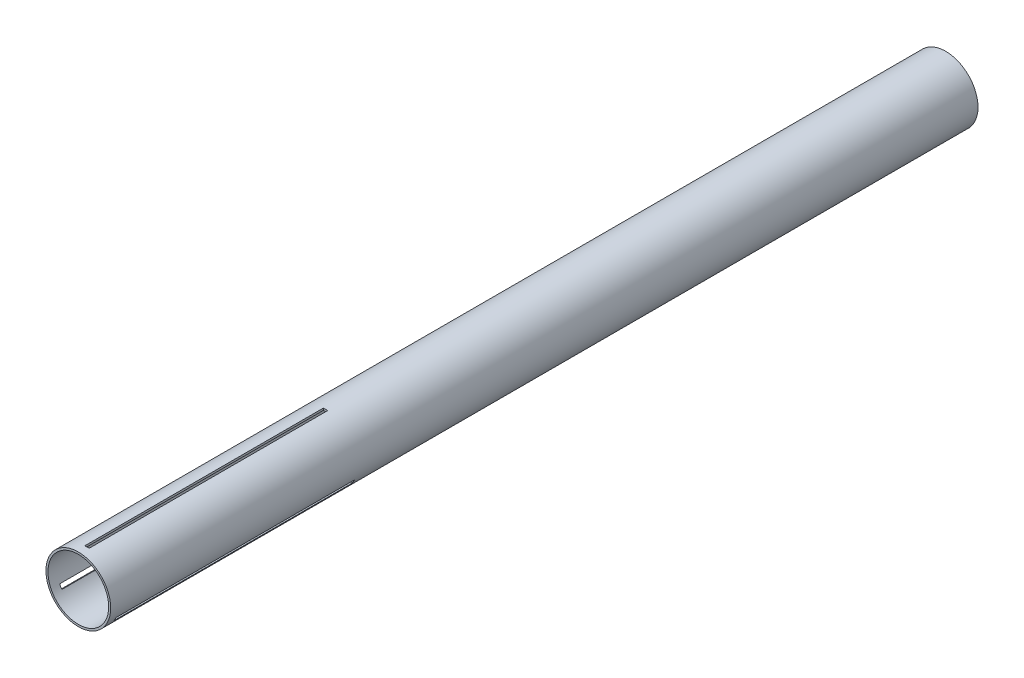
ISO-10303-21;
HEADER;
FILE_DESCRIPTION(('STEP AP214'),'2;1');
FILE_NAME('part.step','',(''),(''),'','','');
FILE_SCHEMA(('AUTOMOTIVE_DESIGN { 1 0 10303 214 1 1 1 1 }'));
ENDSEC;
DATA;
#1=APPLICATION_CONTEXT('core data for automotive mechanical design processes');
#2=APPLICATION_PROTOCOL_DEFINITION('international standard','automotive_design',2000,#1);
#3=PRODUCT_CONTEXT('',#1,'mechanical');
#4=PRODUCT('Part','Part','',(#3));
#5=PRODUCT_RELATED_PRODUCT_CATEGORY('part','',(#4));
#6=PRODUCT_DEFINITION_FORMATION('','',#4);
#7=PRODUCT_DEFINITION_CONTEXT('part definition',#1,'design');
#8=PRODUCT_DEFINITION('design','',#6,#7);
#9=PRODUCT_DEFINITION_SHAPE('','',#8);
#10=(LENGTH_UNIT() NAMED_UNIT(*) SI_UNIT(.MILLI.,.METRE.));
#11=(NAMED_UNIT(*) PLANE_ANGLE_UNIT() SI_UNIT($,.RADIAN.));
#12=(NAMED_UNIT(*) SI_UNIT($,.STERADIAN.) SOLID_ANGLE_UNIT());
#13=UNCERTAINTY_MEASURE_WITH_UNIT(LENGTH_MEASURE(1.E-05),#10,'distance_accuracy_value','');
#14=(GEOMETRIC_REPRESENTATION_CONTEXT(3) GLOBAL_UNCERTAINTY_ASSIGNED_CONTEXT((#13)) GLOBAL_UNIT_ASSIGNED_CONTEXT((#10,
#11,#12)) REPRESENTATION_CONTEXT('',''));
#15=CARTESIAN_POINT('',(0.,0.,0.));
#16=DIRECTION('',(0.,0.,1.));
#17=DIRECTION('',(1.,0.,0.));
#18=AXIS2_PLACEMENT_3D('',#15,#16,#17);
#19=CARTESIAN_POINT('',(0.,0.,635.));
#20=DIRECTION('',(0.,0.,1.));
#21=DIRECTION('',(1.,0.,0.));
#22=AXIS2_PLACEMENT_3D('',#19,#20,#21);
#23=PLANE('',#22);
#24=CARTESIAN_POINT('',(0.,0.,635.));
#25=DIRECTION('',(0.,0.,1.));
#26=DIRECTION('',(1.,0.,0.));
#27=AXIS2_PLACEMENT_3D('',#24,#25,#26);
#28=CIRCLE('',#27,23.6982);
#29=CARTESIAN_POINT('',(23.6982,0.,635.));
#30=VERTEX_POINT('',#29);
#31=EDGE_CURVE('E11',#30,#30,#28,.T.);
#32=ORIENTED_EDGE('',*,*,#31,.T.);
#33=EDGE_LOOP('',(#32));
#34=FACE_BOUND('',#33,.T.);
#35=CARTESIAN_POINT('',(0.,0.,635.));
#36=DIRECTION('',(0.,0.,1.));
#37=DIRECTION('',(1.,0.,0.));
#38=AXIS2_PLACEMENT_3D('',#35,#36,#37);
#39=CIRCLE('',#38,22.225);
#40=CARTESIAN_POINT('',(22.225,0.,635.));
#41=VERTEX_POINT('',#40);
#42=EDGE_CURVE('E224',#41,#41,#39,.T.);
#43=ORIENTED_EDGE('',*,*,#42,.F.);
#44=EDGE_LOOP('',(#43));
#45=FACE_BOUND('',#44,.T.);
#46=ADVANCED_FACE('F32',(#34,#45),#23,.T.);
#47=CARTESIAN_POINT('',(0.,0.,0.));
#48=DIRECTION('',(0.,0.,1.));
#49=DIRECTION('',(1.,0.,0.));
#50=AXIS2_PLACEMENT_3D('',#47,#48,#49);
#51=PLANE('',#50);
#52=CARTESIAN_POINT('',(0.,0.,0.));
#53=DIRECTION('',(0.,0.,1.));
#54=DIRECTION('',(1.,0.,0.));
#55=AXIS2_PLACEMENT_3D('',#52,#53,#54);
#56=CIRCLE('',#55,23.6982);
#57=CARTESIAN_POINT('',(23.6982,0.,0.));
#58=VERTEX_POINT('',#57);
#59=EDGE_CURVE('E36',#58,#58,#56,.T.);
#60=ORIENTED_EDGE('',*,*,#59,.F.);
#61=EDGE_LOOP('',(#60));
#62=FACE_BOUND('',#61,.T.);
#63=CARTESIAN_POINT('',(0.,0.,0.));
#64=DIRECTION('',(0.,0.,1.));
#65=DIRECTION('',(1.,0.,0.));
#66=AXIS2_PLACEMENT_3D('',#63,#64,#65);
#67=CIRCLE('',#66,22.225);
#68=CARTESIAN_POINT('',(22.225,0.,0.));
#69=VERTEX_POINT('',#68);
#70=EDGE_CURVE('E223',#69,#69,#67,.T.);
#71=ORIENTED_EDGE('',*,*,#70,.T.);
#72=EDGE_LOOP('',(#71));
#73=FACE_BOUND('',#72,.T.);
#74=ADVANCED_FACE('F230',(#62,#73),#51,.F.);
#75=CARTESIAN_POINT('',(0.,0.,635.));
#76=DIRECTION('',(0.,0.,-1.));
#77=DIRECTION('',(-1.,0.,0.));
#78=AXIS2_PLACEMENT_3D('',#75,#76,#77);
#79=CYLINDRICAL_SURFACE('',#78,23.6982);
#80=CARTESIAN_POINT('',(0.,0.,454.025));
#81=DIRECTION('',(0.,0.,-1.));
#82=DIRECTION('',(-1.,0.,0.));
#83=AXIS2_PLACEMENT_3D('',#80,#81,#82);
#84=CIRCLE('',#83,23.6982);
#85=CARTESIAN_POINT('',(19.6833932392926,-13.1972994899476,454.025));
#86=VERTEX_POINT('',#85);
#87=CARTESIAN_POINT('',(21.2708932392925,-10.447668832932,454.025));
#88=VERTEX_POINT('',#87);
#89=EDGE_CURVE('E137',#86,#88,#84,.F.);
#90=ORIENTED_EDGE('',*,*,#89,.F.);
#91=DIRECTION('',(0.,0.,-1.));
#92=VECTOR('',#91,1.);
#93=CARTESIAN_POINT('',(19.6833932392926,-13.1972994899476,635.));
#94=LINE('',#93,#92);
#95=CARTESIAN_POINT('',(19.6833932392926,-13.1972994899476,628.65));
#96=VERTEX_POINT('',#95);
#97=EDGE_CURVE('E158',#96,#86,#94,.T.);
#98=ORIENTED_EDGE('',*,*,#97,.F.);
#99=CARTESIAN_POINT('',(0.,0.,628.65));
#100=DIRECTION('',(0.,0.,1.));
#101=DIRECTION('',(1.,0.,0.));
#102=AXIS2_PLACEMENT_3D('',#99,#100,#101);
#103=CIRCLE('',#102,23.6982);
#104=CARTESIAN_POINT('',(21.2708932392925,-10.447668832932,628.65));
#105=VERTEX_POINT('',#104);
#106=EDGE_CURVE('E150',#105,#96,#103,.F.);
#107=ORIENTED_EDGE('',*,*,#106,.F.);
#108=DIRECTION('',(0.,0.,-1.));
#109=VECTOR('',#108,1.);
#110=CARTESIAN_POINT('',(21.2708932392925,-10.447668832932,635.));
#111=LINE('',#110,#109);
#112=EDGE_CURVE('E47',#88,#105,#111,.F.);
#113=ORIENTED_EDGE('',*,*,#112,.F.);
#114=EDGE_LOOP('',(#90,#98,#107,#113));
#115=FACE_BOUND('',#114,.T.);
#116=CARTESIAN_POINT('',(0.,0.,454.025));
#117=DIRECTION('',(0.,0.,-1.));
#118=DIRECTION('',(-1.,0.,0.));
#119=AXIS2_PLACEMENT_3D('',#116,#117,#118);
#120=CIRCLE('',#119,23.6982);
#121=CARTESIAN_POINT('',(-21.2708932392924,-10.4476688329323,454.025));
#122=VERTEX_POINT('',#121);
#123=CARTESIAN_POINT('',(-19.6833932392924,-13.1972994899479,454.025));
#124=VERTEX_POINT('',#123);
#125=EDGE_CURVE('E170',#122,#124,#120,.F.);
#126=ORIENTED_EDGE('',*,*,#125,.F.);
#127=DIRECTION('',(0.,0.,-1.));
#128=VECTOR('',#127,1.);
#129=CARTESIAN_POINT('',(-21.2708932392924,-10.4476688329323,635.));
#130=LINE('',#129,#128);
#131=CARTESIAN_POINT('',(-21.2708932392924,-10.4476688329323,628.65));
#132=VERTEX_POINT('',#131);
#133=EDGE_CURVE('E188',#132,#122,#130,.T.);
#134=ORIENTED_EDGE('',*,*,#133,.F.);
#135=CARTESIAN_POINT('',(0.,0.,628.65));
#136=DIRECTION('',(0.,0.,1.));
#137=DIRECTION('',(1.,0.,0.));
#138=AXIS2_PLACEMENT_3D('',#135,#136,#137);
#139=CIRCLE('',#138,23.6982);
#140=CARTESIAN_POINT('',(-19.6833932392924,-13.1972994899479,628.65));
#141=VERTEX_POINT('',#140);
#142=EDGE_CURVE('E174',#141,#132,#139,.F.);
#143=ORIENTED_EDGE('',*,*,#142,.F.);
#144=DIRECTION('',(0.,0.,-1.));
#145=VECTOR('',#144,1.);
#146=CARTESIAN_POINT('',(-19.6833932392924,-13.1972994899479,635.));
#147=LINE('',#146,#145);
#148=EDGE_CURVE('E55',#124,#141,#147,.F.);
#149=ORIENTED_EDGE('',*,*,#148,.F.);
#150=EDGE_LOOP('',(#126,#134,#143,#149));
#151=FACE_BOUND('',#150,.T.);
#152=CARTESIAN_POINT('',(0.,0.,454.025));
#153=DIRECTION('',(0.,0.,-1.));
#154=DIRECTION('',(-1.,0.,0.));
#155=AXIS2_PLACEMENT_3D('',#152,#153,#154);
#156=CIRCLE('',#155,23.6982);
#157=CARTESIAN_POINT('',(1.5875,23.64496832288,454.025));
#158=VERTEX_POINT('',#157);
#159=CARTESIAN_POINT('',(-1.5875,23.64496832288,454.025));
#160=VERTEX_POINT('',#159);
#161=EDGE_CURVE('E200',#158,#160,#156,.F.);
#162=ORIENTED_EDGE('',*,*,#161,.F.);
#163=DIRECTION('',(0.,0.,-1.));
#164=VECTOR('',#163,1.);
#165=CARTESIAN_POINT('',(1.5875,23.64496832288,635.));
#166=LINE('',#165,#164);
#167=CARTESIAN_POINT('',(1.5875,23.64496832288,628.65));
#168=VERTEX_POINT('',#167);
#169=EDGE_CURVE('E220',#168,#158,#166,.T.);
#170=ORIENTED_EDGE('',*,*,#169,.F.);
#171=CARTESIAN_POINT('',(0.,0.,628.65));
#172=DIRECTION('',(0.,0.,1.));
#173=DIRECTION('',(1.,0.,0.));
#174=AXIS2_PLACEMENT_3D('',#171,#172,#173);
#175=CIRCLE('',#174,23.6982);
#176=CARTESIAN_POINT('',(-1.5875,23.64496832288,628.65));
#177=VERTEX_POINT('',#176);
#178=EDGE_CURVE('E204',#177,#168,#175,.F.);
#179=ORIENTED_EDGE('',*,*,#178,.F.);
#180=DIRECTION('',(0.,0.,-1.));
#181=VECTOR('',#180,1.);
#182=CARTESIAN_POINT('',(-1.5875,23.64496832288,635.));
#183=LINE('',#182,#181);
#184=EDGE_CURVE('E202',#160,#177,#183,.F.);
#185=ORIENTED_EDGE('',*,*,#184,.F.);
#186=EDGE_LOOP('',(#162,#170,#179,#185));
#187=FACE_BOUND('',#186,.T.);
#188=ORIENTED_EDGE('',*,*,#31,.F.);
#189=EDGE_LOOP('',(#188));
#190=FACE_BOUND('',#189,.T.);
#191=ORIENTED_EDGE('',*,*,#59,.T.);
#192=EDGE_LOOP('',(#191));
#193=FACE_BOUND('',#192,.T.);
#194=ADVANCED_FACE('F34',(#115,#151,#187,#190,#193),#79,.T.);
#195=CARTESIAN_POINT('',(0.,0.,635.));
#196=DIRECTION('',(0.,0.,-1.));
#197=DIRECTION('',(-1.,0.,0.));
#198=AXIS2_PLACEMENT_3D('',#195,#196,#197);
#199=CYLINDRICAL_SURFACE('',#198,22.225);
#200=DIRECTION('',(0.,0.,-1.));
#201=VECTOR('',#200,1.);
#202=CARTESIAN_POINT('',(18.404501263136,-12.4589308632492,635.));
#203=LINE('',#202,#201);
#204=CARTESIAN_POINT('',(18.404501263136,-12.4589308632492,628.65));
#205=VERTEX_POINT('',#204);
#206=CARTESIAN_POINT('',(18.4045012631361,-12.4589308632492,454.025));
#207=VERTEX_POINT('',#206);
#208=EDGE_CURVE('E144',#205,#207,#203,.T.);
#209=ORIENTED_EDGE('',*,*,#208,.T.);
#210=CARTESIAN_POINT('',(0.,0.,454.025));
#211=DIRECTION('',(0.,0.,-1.));
#212=DIRECTION('',(-1.,0.,0.));
#213=AXIS2_PLACEMENT_3D('',#210,#211,#212);
#214=CIRCLE('',#213,22.225);
#215=CARTESIAN_POINT('',(19.992001263136,-9.70930020623361,454.025));
#216=VERTEX_POINT('',#215);
#217=EDGE_CURVE('E131',#207,#216,#214,.F.);
#218=ORIENTED_EDGE('',*,*,#217,.T.);
#219=DIRECTION('',(0.,0.,-1.));
#220=VECTOR('',#219,1.);
#221=CARTESIAN_POINT('',(19.992001263136,-9.70930020623361,635.));
#222=LINE('',#221,#220);
#223=CARTESIAN_POINT('',(19.992001263136,-9.70930020623361,628.65));
#224=VERTEX_POINT('',#223);
#225=EDGE_CURVE('E121',#216,#224,#222,.F.);
#226=ORIENTED_EDGE('',*,*,#225,.T.);
#227=CARTESIAN_POINT('',(0.,0.,628.65));
#228=DIRECTION('',(0.,0.,1.));
#229=DIRECTION('',(1.,0.,0.));
#230=AXIS2_PLACEMENT_3D('',#227,#228,#229);
#231=CIRCLE('',#230,22.225);
#232=EDGE_CURVE('E130',#224,#205,#231,.F.);
#233=ORIENTED_EDGE('',*,*,#232,.T.);
#234=EDGE_LOOP('',(#209,#218,#226,#233));
#235=FACE_BOUND('',#234,.T.);
#236=DIRECTION('',(0.,0.,-1.));
#237=VECTOR('',#236,1.);
#238=CARTESIAN_POINT('',(-19.9920012631359,-9.70930020623389,635.));
#239=LINE('',#238,#237);
#240=CARTESIAN_POINT('',(-19.9920012631359,-9.70930020623389,628.65));
#241=VERTEX_POINT('',#240);
#242=CARTESIAN_POINT('',(-19.9920012631359,-9.70930020623389,454.025));
#243=VERTEX_POINT('',#242);
#244=EDGE_CURVE('E180',#241,#243,#239,.T.);
#245=ORIENTED_EDGE('',*,*,#244,.T.);
#246=CARTESIAN_POINT('',(0.,0.,454.025));
#247=DIRECTION('',(0.,0.,-1.));
#248=DIRECTION('',(-1.,0.,0.));
#249=AXIS2_PLACEMENT_3D('',#246,#247,#248);
#250=CIRCLE('',#249,22.225);
#251=CARTESIAN_POINT('',(-18.4045012631359,-12.4589308632495,454.025));
#252=VERTEX_POINT('',#251);
#253=EDGE_CURVE('E161',#243,#252,#250,.F.);
#254=ORIENTED_EDGE('',*,*,#253,.T.);
#255=DIRECTION('',(0.,0.,-1.));
#256=VECTOR('',#255,1.);
#257=CARTESIAN_POINT('',(-18.4045012631359,-12.4589308632495,635.));
#258=LINE('',#257,#256);
#259=CARTESIAN_POINT('',(-18.4045012631359,-12.4589308632495,628.65));
#260=VERTEX_POINT('',#259);
#261=EDGE_CURVE('E164',#252,#260,#258,.F.);
#262=ORIENTED_EDGE('',*,*,#261,.T.);
#263=CARTESIAN_POINT('',(0.,0.,628.65));
#264=DIRECTION('',(0.,0.,1.));
#265=DIRECTION('',(1.,0.,0.));
#266=AXIS2_PLACEMENT_3D('',#263,#264,#265);
#267=CIRCLE('',#266,22.225);
#268=EDGE_CURVE('E167',#260,#241,#267,.F.);
#269=ORIENTED_EDGE('',*,*,#268,.T.);
#270=EDGE_LOOP('',(#245,#254,#262,#269));
#271=FACE_BOUND('',#270,.T.);
#272=DIRECTION('',(0.,0.,-1.));
#273=VECTOR('',#272,1.);
#274=CARTESIAN_POINT('',(1.5875,22.1682310694832,635.));
#275=LINE('',#274,#273);
#276=CARTESIAN_POINT('',(1.5875,22.1682310694832,628.65));
#277=VERTEX_POINT('',#276);
#278=CARTESIAN_POINT('',(1.5875,22.1682310694832,454.025));
#279=VERTEX_POINT('',#278);
#280=EDGE_CURVE('E210',#277,#279,#275,.T.);
#281=ORIENTED_EDGE('',*,*,#280,.T.);
#282=CARTESIAN_POINT('',(0.,0.,454.025));
#283=DIRECTION('',(0.,0.,-1.));
#284=DIRECTION('',(-1.,0.,0.));
#285=AXIS2_PLACEMENT_3D('',#282,#283,#284);
#286=CIRCLE('',#285,22.225);
#287=CARTESIAN_POINT('',(-1.5875,22.1682310694832,454.025));
#288=VERTEX_POINT('',#287);
#289=EDGE_CURVE('E191',#279,#288,#286,.F.);
#290=ORIENTED_EDGE('',*,*,#289,.T.);
#291=DIRECTION('',(0.,0.,-1.));
#292=VECTOR('',#291,1.);
#293=CARTESIAN_POINT('',(-1.5875,22.1682310694832,635.));
#294=LINE('',#293,#292);
#295=CARTESIAN_POINT('',(-1.5875,22.1682310694832,628.65));
#296=VERTEX_POINT('',#295);
#297=EDGE_CURVE('E194',#288,#296,#294,.F.);
#298=ORIENTED_EDGE('',*,*,#297,.T.);
#299=CARTESIAN_POINT('',(0.,0.,628.65));
#300=DIRECTION('',(0.,0.,1.));
#301=DIRECTION('',(1.,0.,0.));
#302=AXIS2_PLACEMENT_3D('',#299,#300,#301);
#303=CIRCLE('',#302,22.225);
#304=EDGE_CURVE('E197',#296,#277,#303,.F.);
#305=ORIENTED_EDGE('',*,*,#304,.T.);
#306=EDGE_LOOP('',(#281,#290,#298,#305));
#307=FACE_BOUND('',#306,.T.);
#308=ORIENTED_EDGE('',*,*,#42,.T.);
#309=EDGE_LOOP('',(#308));
#310=FACE_BOUND('',#309,.T.);
#311=ORIENTED_EDGE('',*,*,#70,.F.);
#312=EDGE_LOOP('',(#311));
#313=FACE_BOUND('',#312,.T.);
#314=ADVANCED_FACE('F141',(#235,#271,#307,#310,#313),#199,.F.);
#315=CARTESIAN_POINT('',(1.5875,-23.6992,628.65));
#316=DIRECTION('',(1.,0.,0.));
#317=DIRECTION('',(0.,0.,-1.));
#318=AXIS2_PLACEMENT_3D('',#315,#316,#317);
#319=PLANE('',#318);
#320=ORIENTED_EDGE('',*,*,#169,.T.);
#321=DIRECTION('',(0.,1.,0.));
#322=VECTOR('',#321,1.);
#323=CARTESIAN_POINT('',(1.5875,-23.6992,454.025));
#324=LINE('',#323,#322);
#325=EDGE_CURVE('E214',#279,#158,#324,.T.);
#326=ORIENTED_EDGE('',*,*,#325,.F.);
#327=ORIENTED_EDGE('',*,*,#280,.F.);
#328=DIRECTION('',(0.,1.,0.));
#329=VECTOR('',#328,1.);
#330=CARTESIAN_POINT('',(1.5875,-23.6992,628.65));
#331=LINE('',#330,#329);
#332=EDGE_CURVE('E206',#277,#168,#331,.T.);
#333=ORIENTED_EDGE('',*,*,#332,.T.);
#334=EDGE_LOOP('',(#320,#326,#327,#333));
#335=FACE_BOUND('',#334,.T.);
#336=ADVANCED_FACE('F233',(#335),#319,.F.);
#337=CARTESIAN_POINT('',(-1.5875,-23.6992,454.025));
#338=DIRECTION('',(0.,0.,-1.));
#339=DIRECTION('',(-1.,0.,0.));
#340=AXIS2_PLACEMENT_3D('',#337,#338,#339);
#341=PLANE('',#340);
#342=ORIENTED_EDGE('',*,*,#161,.T.);
#343=DIRECTION('',(0.,1.,0.));
#344=VECTOR('',#343,1.);
#345=CARTESIAN_POINT('',(-1.5875,-23.6992,454.025));
#346=LINE('',#345,#344);
#347=EDGE_CURVE('E211',#288,#160,#346,.T.);
#348=ORIENTED_EDGE('',*,*,#347,.F.);
#349=ORIENTED_EDGE('',*,*,#289,.F.);
#350=ORIENTED_EDGE('',*,*,#325,.T.);
#351=EDGE_LOOP('',(#342,#348,#349,#350));
#352=FACE_BOUND('',#351,.T.);
#353=ADVANCED_FACE('F239',(#352),#341,.F.);
#354=CARTESIAN_POINT('',(-1.5875,-23.6992,628.65));
#355=DIRECTION('',(-1.,0.,0.));
#356=DIRECTION('',(0.,0.,1.));
#357=AXIS2_PLACEMENT_3D('',#354,#355,#356);
#358=PLANE('',#357);
#359=ORIENTED_EDGE('',*,*,#184,.T.);
#360=DIRECTION('',(0.,1.,0.));
#361=VECTOR('',#360,1.);
#362=CARTESIAN_POINT('',(-1.5875,-23.6992,628.65));
#363=LINE('',#362,#361);
#364=EDGE_CURVE('E207',#296,#177,#363,.T.);
#365=ORIENTED_EDGE('',*,*,#364,.F.);
#366=ORIENTED_EDGE('',*,*,#297,.F.);
#367=ORIENTED_EDGE('',*,*,#347,.T.);
#368=EDGE_LOOP('',(#359,#365,#366,#367));
#369=FACE_BOUND('',#368,.T.);
#370=ADVANCED_FACE('F357',(#369),#358,.F.);
#371=CARTESIAN_POINT('',(-1.5875,-23.6992,628.65));
#372=DIRECTION('',(0.,0.,1.));
#373=DIRECTION('',(1.,0.,0.));
#374=AXIS2_PLACEMENT_3D('',#371,#372,#373);
#375=PLANE('',#374);
#376=ORIENTED_EDGE('',*,*,#178,.T.);
#377=ORIENTED_EDGE('',*,*,#332,.F.);
#378=ORIENTED_EDGE('',*,*,#304,.F.);
#379=ORIENTED_EDGE('',*,*,#364,.T.);
#380=EDGE_LOOP('',(#376,#377,#378,#379));
#381=FACE_BOUND('',#380,.T.);
#382=ADVANCED_FACE('F272',(#381),#375,.F.);
#383=CARTESIAN_POINT('',(27.242704624684,17.561669953192,628.65));
#384=DIRECTION('',(-0.500000000000004,0.866025403784436,0.));
#385=DIRECTION('',(-0.866025403784436,-0.500000000000004,0.));
#386=AXIS2_PLACEMENT_3D('',#383,#384,#385);
#387=PLANE('',#386);
#388=ORIENTED_EDGE('',*,*,#133,.T.);
#389=DIRECTION('',(-0.866025403784436,-0.500000000000004,0.));
#390=VECTOR('',#389,1.);
#391=CARTESIAN_POINT('',(27.242704624684,17.561669953192,454.025));
#392=LINE('',#391,#390);
#393=EDGE_CURVE('E183',#243,#122,#392,.T.);
#394=ORIENTED_EDGE('',*,*,#393,.F.);
#395=ORIENTED_EDGE('',*,*,#244,.F.);
#396=DIRECTION('',(-0.866025403784436,-0.500000000000004,0.));
#397=VECTOR('',#396,1.);
#398=CARTESIAN_POINT('',(27.242704624684,17.561669953192,628.65));
#399=LINE('',#398,#397);
#400=EDGE_CURVE('E177',#241,#132,#399,.T.);
#401=ORIENTED_EDGE('',*,*,#400,.T.);
#402=EDGE_LOOP('',(#388,#394,#395,#401));
#403=FACE_BOUND('',#402,.T.);
#404=ADVANCED_FACE('F282',(#403),#387,.F.);
#405=CARTESIAN_POINT('',(28.830204624684,14.8120392961764,454.025));
#406=DIRECTION('',(0.,0.,-1.));
#407=DIRECTION('',(-1.,0.,0.));
#408=AXIS2_PLACEMENT_3D('',#405,#406,#407);
#409=PLANE('',#408);
#410=ORIENTED_EDGE('',*,*,#125,.T.);
#411=DIRECTION('',(-0.866025403784436,-0.500000000000004,0.));
#412=VECTOR('',#411,1.);
#413=CARTESIAN_POINT('',(28.830204624684,14.8120392961764,454.025));
#414=LINE('',#413,#412);
#415=EDGE_CURVE('E181',#252,#124,#414,.T.);
#416=ORIENTED_EDGE('',*,*,#415,.F.);
#417=ORIENTED_EDGE('',*,*,#253,.F.);
#418=ORIENTED_EDGE('',*,*,#393,.T.);
#419=EDGE_LOOP('',(#410,#416,#417,#418));
#420=FACE_BOUND('',#419,.T.);
#421=ADVANCED_FACE('F287',(#420),#409,.F.);
#422=CARTESIAN_POINT('',(28.830204624684,14.8120392961764,628.65));
#423=DIRECTION('',(0.500000000000004,-0.866025403784436,0.));
#424=DIRECTION('',(0.866025403784436,0.500000000000004,0.));
#425=AXIS2_PLACEMENT_3D('',#422,#423,#424);
#426=PLANE('',#425);
#427=ORIENTED_EDGE('',*,*,#148,.T.);
#428=DIRECTION('',(-0.866025403784436,-0.500000000000004,0.));
#429=VECTOR('',#428,1.);
#430=CARTESIAN_POINT('',(28.830204624684,14.8120392961764,628.65));
#431=LINE('',#430,#429);
#432=EDGE_CURVE('E178',#260,#141,#431,.T.);
#433=ORIENTED_EDGE('',*,*,#432,.F.);
#434=ORIENTED_EDGE('',*,*,#261,.F.);
#435=ORIENTED_EDGE('',*,*,#415,.T.);
#436=EDGE_LOOP('',(#427,#433,#434,#435));
#437=FACE_BOUND('',#436,.T.);
#438=ADVANCED_FACE('F297',(#437),#426,.F.);
#439=CARTESIAN_POINT('',(28.830204624684,14.8120392961764,628.65));
#440=DIRECTION('',(0.,0.,1.));
#441=DIRECTION('',(1.,0.,0.));
#442=AXIS2_PLACEMENT_3D('',#439,#440,#441);
#443=PLANE('',#442);
#444=ORIENTED_EDGE('',*,*,#142,.T.);
#445=ORIENTED_EDGE('',*,*,#400,.F.);
#446=ORIENTED_EDGE('',*,*,#268,.F.);
#447=ORIENTED_EDGE('',*,*,#432,.T.);
#448=EDGE_LOOP('',(#444,#445,#446,#447));
#449=FACE_BOUND('',#448,.T.);
#450=ADVANCED_FACE('F307',(#449),#443,.F.);
#451=CARTESIAN_POINT('',(-28.8302046246841,14.812039296176,628.65));
#452=DIRECTION('',(-0.499999999999992,-0.866025403784443,0.));
#453=DIRECTION('',(0.866025403784443,-0.499999999999992,0.));
#454=AXIS2_PLACEMENT_3D('',#451,#452,#453);
#455=PLANE('',#454);
#456=ORIENTED_EDGE('',*,*,#97,.T.);
#457=DIRECTION('',(0.866025403784443,-0.499999999999992,0.));
#458=VECTOR('',#457,1.);
#459=CARTESIAN_POINT('',(-28.8302046246841,14.812039296176,454.025));
#460=LINE('',#459,#458);
#461=EDGE_CURVE('E138',#207,#86,#460,.T.);
#462=ORIENTED_EDGE('',*,*,#461,.F.);
#463=ORIENTED_EDGE('',*,*,#208,.F.);
#464=DIRECTION('',(0.866025403784443,-0.499999999999992,0.));
#465=VECTOR('',#464,1.);
#466=CARTESIAN_POINT('',(-28.8302046246841,14.812039296176,628.65));
#467=LINE('',#466,#465);
#468=EDGE_CURVE('E153',#205,#96,#467,.T.);
#469=ORIENTED_EDGE('',*,*,#468,.T.);
#470=EDGE_LOOP('',(#456,#462,#463,#469));
#471=FACE_BOUND('',#470,.T.);
#472=ADVANCED_FACE('F316',(#471),#455,.F.);
#473=CARTESIAN_POINT('',(-27.2427046246842,17.5616699531916,454.025));
#474=DIRECTION('',(0.,0.,-1.));
#475=DIRECTION('',(-1.,0.,0.));
#476=AXIS2_PLACEMENT_3D('',#473,#474,#475);
#477=PLANE('',#476);
#478=ORIENTED_EDGE('',*,*,#89,.T.);
#479=DIRECTION('',(0.866025403784443,-0.499999999999992,0.));
#480=VECTOR('',#479,1.);
#481=CARTESIAN_POINT('',(-27.2427046246842,17.5616699531916,454.025));
#482=LINE('',#481,#480);
#483=EDGE_CURVE('E124',#216,#88,#482,.T.);
#484=ORIENTED_EDGE('',*,*,#483,.F.);
#485=ORIENTED_EDGE('',*,*,#217,.F.);
#486=ORIENTED_EDGE('',*,*,#461,.T.);
#487=EDGE_LOOP('',(#478,#484,#485,#486));
#488=FACE_BOUND('',#487,.T.);
#489=ADVANCED_FACE('F134',(#488),#477,.F.);
#490=CARTESIAN_POINT('',(-27.2427046246842,17.5616699531916,628.65));
#491=DIRECTION('',(0.499999999999992,0.866025403784443,0.));
#492=DIRECTION('',(-0.866025403784443,0.499999999999992,0.));
#493=AXIS2_PLACEMENT_3D('',#490,#491,#492);
#494=PLANE('',#493);
#495=ORIENTED_EDGE('',*,*,#112,.T.);
#496=DIRECTION('',(0.866025403784443,-0.499999999999992,0.));
#497=VECTOR('',#496,1.);
#498=CARTESIAN_POINT('',(-27.2427046246842,17.5616699531916,628.65));
#499=LINE('',#498,#497);
#500=EDGE_CURVE('E126',#224,#105,#499,.T.);
#501=ORIENTED_EDGE('',*,*,#500,.F.);
#502=ORIENTED_EDGE('',*,*,#225,.F.);
#503=ORIENTED_EDGE('',*,*,#483,.T.);
#504=EDGE_LOOP('',(#495,#501,#502,#503));
#505=FACE_BOUND('',#504,.T.);
#506=ADVANCED_FACE('F123',(#505),#494,.F.);
#507=CARTESIAN_POINT('',(-27.2427046246842,17.5616699531916,628.65));
#508=DIRECTION('',(0.,0.,1.));
#509=DIRECTION('',(1.,0.,0.));
#510=AXIS2_PLACEMENT_3D('',#507,#508,#509);
#511=PLANE('',#510);
#512=ORIENTED_EDGE('',*,*,#106,.T.);
#513=ORIENTED_EDGE('',*,*,#468,.F.);
#514=ORIENTED_EDGE('',*,*,#232,.F.);
#515=ORIENTED_EDGE('',*,*,#500,.T.);
#516=EDGE_LOOP('',(#512,#513,#514,#515));
#517=FACE_BOUND('',#516,.T.);
#518=ADVANCED_FACE('F343',(#517),#511,.F.);
#519=CLOSED_SHELL('',(#46,#74,#194,#314,#336,#353,#370,#382,#404,#421,#438,#450,#472,#489,#506,#518));
#520=MANIFOLD_SOLID_BREP('B2',#519);
#521=ADVANCED_BREP_SHAPE_REPRESENTATION('',(#18,#520),#14);
#522=SHAPE_DEFINITION_REPRESENTATION(#9,#521);
ENDSEC;
END-ISO-10303-21;
